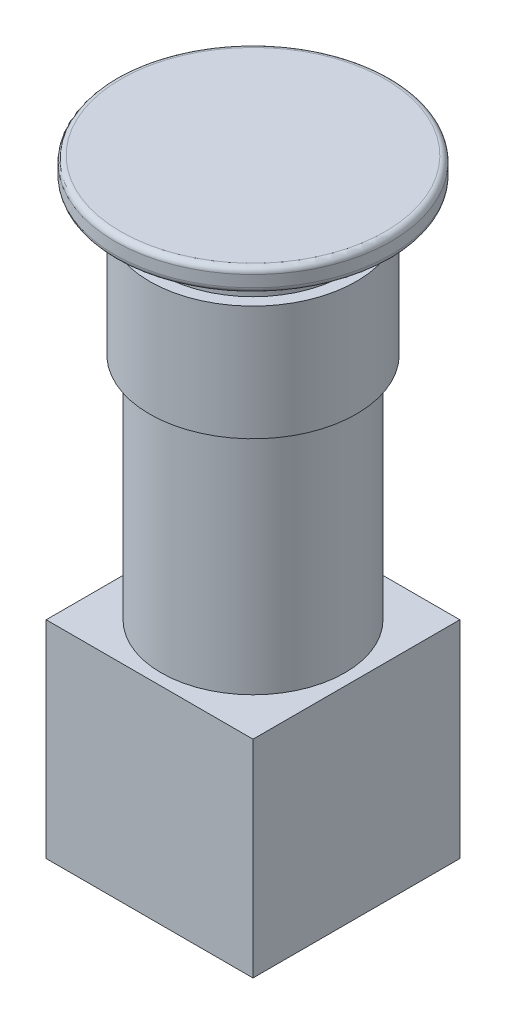
ISO-10303-21;
HEADER;
FILE_DESCRIPTION(('STEP AP214'),'2;1');
FILE_NAME('part.step','',(''),(''),'','','');
FILE_SCHEMA(('AUTOMOTIVE_DESIGN { 1 0 10303 214 1 1 1 1 }'));
ENDSEC;
DATA;
#1=APPLICATION_CONTEXT('core data for automotive mechanical design processes');
#2=APPLICATION_PROTOCOL_DEFINITION('international standard','automotive_design',2000,#1);
#3=PRODUCT_CONTEXT('',#1,'mechanical');
#4=PRODUCT('Part','Part','',(#3));
#5=PRODUCT_RELATED_PRODUCT_CATEGORY('part','',(#4));
#6=PRODUCT_DEFINITION_FORMATION('','',#4);
#7=PRODUCT_DEFINITION_CONTEXT('part definition',#1,'design');
#8=PRODUCT_DEFINITION('design','',#6,#7);
#9=PRODUCT_DEFINITION_SHAPE('','',#8);
#10=(LENGTH_UNIT() NAMED_UNIT(*) SI_UNIT(.MILLI.,.METRE.));
#11=(NAMED_UNIT(*) PLANE_ANGLE_UNIT() SI_UNIT($,.RADIAN.));
#12=(NAMED_UNIT(*) SI_UNIT($,.STERADIAN.) SOLID_ANGLE_UNIT());
#13=UNCERTAINTY_MEASURE_WITH_UNIT(LENGTH_MEASURE(1.E-05),#10,'distance_accuracy_value','');
#14=(GEOMETRIC_REPRESENTATION_CONTEXT(3) GLOBAL_UNCERTAINTY_ASSIGNED_CONTEXT((#13)) GLOBAL_UNIT_ASSIGNED_CONTEXT((#10,
#11,#12)) REPRESENTATION_CONTEXT('',''));
#15=CARTESIAN_POINT('',(0.,0.,0.));
#16=DIRECTION('',(0.,0.,1.));
#17=DIRECTION('',(1.,0.,0.));
#18=AXIS2_PLACEMENT_3D('',#15,#16,#17);
#19=CARTESIAN_POINT('',(0.,48.,0.));
#20=DIRECTION('',(0.,1.,0.));
#21=DIRECTION('',(0.,0.,1.));
#22=AXIS2_PLACEMENT_3D('',#19,#20,#21);
#23=PLANE('',#22);
#24=CARTESIAN_POINT('',(0.,48.,0.));
#25=DIRECTION('',(0.,1.,0.));
#26=DIRECTION('',(0.,0.,1.));
#27=AXIS2_PLACEMENT_3D('',#24,#25,#26);
#28=CIRCLE('',#27,9.);
#29=CARTESIAN_POINT('',(0.,48.,9.));
#30=VERTEX_POINT('',#29);
#31=EDGE_CURVE('E178',#30,#30,#28,.T.);
#32=ORIENTED_EDGE('',*,*,#31,.T.);
#33=EDGE_LOOP('',(#32));
#34=FACE_BOUND('',#33,.T.);
#35=CARTESIAN_POINT('',(0.,48.,0.));
#36=DIRECTION('',(0.,1.,0.));
#37=DIRECTION('',(0.,0.,1.));
#38=AXIS2_PLACEMENT_3D('',#35,#36,#37);
#39=CIRCLE('',#38,8.);
#40=CARTESIAN_POINT('',(0.,48.,8.));
#41=VERTEX_POINT('',#40);
#42=EDGE_CURVE('E186',#41,#41,#39,.T.);
#43=ORIENTED_EDGE('',*,*,#42,.F.);
#44=EDGE_LOOP('',(#43));
#45=FACE_BOUND('',#44,.T.);
#46=ADVANCED_FACE('F33',(#34,#45),#23,.T.);
#47=CARTESIAN_POINT('',(0.,18.,0.));
#48=DIRECTION('',(0.,1.,0.));
#49=DIRECTION('',(0.,0.,1.));
#50=AXIS2_PLACEMENT_3D('',#47,#48,#49);
#51=PLANE('',#50);
#52=DIRECTION('',(0.,0.,1.));
#53=VECTOR('',#52,1.);
#54=CARTESIAN_POINT('',(-9.,18.,-9.));
#55=LINE('',#54,#53);
#56=CARTESIAN_POINT('',(-9.,18.,-9.));
#57=VERTEX_POINT('',#56);
#58=CARTESIAN_POINT('',(-9.,18.,9.));
#59=VERTEX_POINT('',#58);
#60=EDGE_CURVE('E87',#57,#59,#55,.T.);
#61=ORIENTED_EDGE('',*,*,#60,.T.);
#62=DIRECTION('',(1.,0.,0.));
#63=VECTOR('',#62,1.);
#64=CARTESIAN_POINT('',(-9.,18.,9.));
#65=LINE('',#64,#63);
#66=CARTESIAN_POINT('',(9.,18.,9.));
#67=VERTEX_POINT('',#66);
#68=EDGE_CURVE('E81',#59,#67,#65,.T.);
#69=ORIENTED_EDGE('',*,*,#68,.T.);
#70=DIRECTION('',(0.,0.,-1.));
#71=VECTOR('',#70,1.);
#72=CARTESIAN_POINT('',(9.,18.,-9.));
#73=LINE('',#72,#71);
#74=CARTESIAN_POINT('',(9.,18.,-9.));
#75=VERTEX_POINT('',#74);
#76=EDGE_CURVE('E85',#67,#75,#73,.T.);
#77=ORIENTED_EDGE('',*,*,#76,.T.);
#78=DIRECTION('',(-1.,0.,0.));
#79=VECTOR('',#78,1.);
#80=CARTESIAN_POINT('',(-9.,18.,-9.));
#81=LINE('',#80,#79);
#82=EDGE_CURVE('E50',#75,#57,#81,.T.);
#83=ORIENTED_EDGE('',*,*,#82,.T.);
#84=EDGE_LOOP('',(#61,#69,#77,#83));
#85=FACE_BOUND('',#84,.T.);
#86=CARTESIAN_POINT('',(0.,18.,0.));
#87=DIRECTION('',(0.,1.,0.));
#88=DIRECTION('',(0.,0.,1.));
#89=AXIS2_PLACEMENT_3D('',#86,#87,#88);
#90=CIRCLE('',#89,8.);
#91=CARTESIAN_POINT('',(0.,18.,8.));
#92=VERTEX_POINT('',#91);
#93=EDGE_CURVE('E175',#92,#92,#90,.T.);
#94=ORIENTED_EDGE('',*,*,#93,.F.);
#95=EDGE_LOOP('',(#94));
#96=FACE_BOUND('',#95,.T.);
#97=ADVANCED_FACE('F82',(#85,#96),#51,.T.);
#98=CARTESIAN_POINT('',(-9.,18.,-9.));
#99=DIRECTION('',(1.,0.,0.));
#100=DIRECTION('',(0.,0.,-1.));
#101=AXIS2_PLACEMENT_3D('',#98,#99,#100);
#102=PLANE('',#101);
#103=DIRECTION('',(0.,0.,1.));
#104=VECTOR('',#103,1.);
#105=CARTESIAN_POINT('',(-9.,0.,-9.));
#106=LINE('',#105,#104);
#107=CARTESIAN_POINT('',(-9.,0.,-9.));
#108=VERTEX_POINT('',#107);
#109=CARTESIAN_POINT('',(-9.,0.,9.));
#110=VERTEX_POINT('',#109);
#111=EDGE_CURVE('E102',#108,#110,#106,.T.);
#112=ORIENTED_EDGE('',*,*,#111,.T.);
#113=DIRECTION('',(0.,-1.,0.));
#114=VECTOR('',#113,1.);
#115=CARTESIAN_POINT('',(-9.,18.,9.));
#116=LINE('',#115,#114);
#117=EDGE_CURVE('E93',#59,#110,#116,.T.);
#118=ORIENTED_EDGE('',*,*,#117,.F.);
#119=ORIENTED_EDGE('',*,*,#60,.F.);
#120=DIRECTION('',(0.,-1.,0.));
#121=VECTOR('',#120,1.);
#122=CARTESIAN_POINT('',(-9.,18.,-9.));
#123=LINE('',#122,#121);
#124=EDGE_CURVE('E98',#57,#108,#123,.T.);
#125=ORIENTED_EDGE('',*,*,#124,.T.);
#126=EDGE_LOOP('',(#112,#118,#119,#125));
#127=FACE_BOUND('',#126,.T.);
#128=ADVANCED_FACE('F138',(#127),#102,.F.);
#129=CARTESIAN_POINT('',(-9.,18.,9.));
#130=DIRECTION('',(0.,0.,-1.));
#131=DIRECTION('',(-1.,0.,0.));
#132=AXIS2_PLACEMENT_3D('',#129,#130,#131);
#133=PLANE('',#132);
#134=DIRECTION('',(1.,0.,0.));
#135=VECTOR('',#134,1.);
#136=CARTESIAN_POINT('',(-9.,0.,9.));
#137=LINE('',#136,#135);
#138=CARTESIAN_POINT('',(9.,0.,9.));
#139=VERTEX_POINT('',#138);
#140=EDGE_CURVE('E92',#110,#139,#137,.T.);
#141=ORIENTED_EDGE('',*,*,#140,.T.);
#142=DIRECTION('',(0.,-1.,0.));
#143=VECTOR('',#142,1.);
#144=CARTESIAN_POINT('',(9.,18.,9.));
#145=LINE('',#144,#143);
#146=EDGE_CURVE('E90',#67,#139,#145,.T.);
#147=ORIENTED_EDGE('',*,*,#146,.F.);
#148=ORIENTED_EDGE('',*,*,#68,.F.);
#149=ORIENTED_EDGE('',*,*,#117,.T.);
#150=EDGE_LOOP('',(#141,#147,#148,#149));
#151=FACE_BOUND('',#150,.T.);
#152=ADVANCED_FACE('F91',(#151),#133,.F.);
#153=CARTESIAN_POINT('',(9.,18.,-9.));
#154=DIRECTION('',(-1.,0.,0.));
#155=DIRECTION('',(0.,0.,1.));
#156=AXIS2_PLACEMENT_3D('',#153,#154,#155);
#157=PLANE('',#156);
#158=DIRECTION('',(0.,0.,-1.));
#159=VECTOR('',#158,1.);
#160=CARTESIAN_POINT('',(9.,0.,-9.));
#161=LINE('',#160,#159);
#162=CARTESIAN_POINT('',(9.,0.,-9.));
#163=VERTEX_POINT('',#162);
#164=EDGE_CURVE('E67',#139,#163,#161,.T.);
#165=ORIENTED_EDGE('',*,*,#164,.T.);
#166=DIRECTION('',(0.,-1.,0.));
#167=VECTOR('',#166,1.);
#168=CARTESIAN_POINT('',(9.,18.,-9.));
#169=LINE('',#168,#167);
#170=EDGE_CURVE('E94',#75,#163,#169,.T.);
#171=ORIENTED_EDGE('',*,*,#170,.F.);
#172=ORIENTED_EDGE('',*,*,#76,.F.);
#173=ORIENTED_EDGE('',*,*,#146,.T.);
#174=EDGE_LOOP('',(#165,#171,#172,#173));
#175=FACE_BOUND('',#174,.T.);
#176=ADVANCED_FACE('F96',(#175),#157,.F.);
#177=CARTESIAN_POINT('',(-9.,18.,-9.));
#178=DIRECTION('',(0.,0.,1.));
#179=DIRECTION('',(1.,0.,0.));
#180=AXIS2_PLACEMENT_3D('',#177,#178,#179);
#181=PLANE('',#180);
#182=DIRECTION('',(-1.,0.,0.));
#183=VECTOR('',#182,1.);
#184=CARTESIAN_POINT('',(-9.,0.,-9.));
#185=LINE('',#184,#183);
#186=EDGE_CURVE('E73',#163,#108,#185,.T.);
#187=ORIENTED_EDGE('',*,*,#186,.T.);
#188=ORIENTED_EDGE('',*,*,#124,.F.);
#189=ORIENTED_EDGE('',*,*,#82,.F.);
#190=ORIENTED_EDGE('',*,*,#170,.T.);
#191=EDGE_LOOP('',(#187,#188,#189,#190));
#192=FACE_BOUND('',#191,.T.);
#193=ADVANCED_FACE('F161',(#192),#181,.F.);
#194=CARTESIAN_POINT('',(0.,0.,0.));
#195=DIRECTION('',(0.,1.,0.));
#196=DIRECTION('',(0.,0.,1.));
#197=AXIS2_PLACEMENT_3D('',#194,#195,#196);
#198=PLANE('',#197);
#199=ORIENTED_EDGE('',*,*,#111,.F.);
#200=ORIENTED_EDGE('',*,*,#186,.F.);
#201=ORIENTED_EDGE('',*,*,#164,.F.);
#202=ORIENTED_EDGE('',*,*,#140,.F.);
#203=EDGE_LOOP('',(#199,#200,#201,#202));
#204=FACE_BOUND('',#203,.T.);
#205=ADVANCED_FACE('F156',(#204),#198,.F.);
#206=CARTESIAN_POINT('',(0.,38.,0.));
#207=DIRECTION('',(0.,-1.,0.));
#208=DIRECTION('',(0.,0.,-1.));
#209=AXIS2_PLACEMENT_3D('',#206,#207,#208);
#210=CYLINDRICAL_SURFACE('',#209,8.);
#211=CARTESIAN_POINT('',(0.,38.,0.));
#212=DIRECTION('',(0.,1.,0.));
#213=DIRECTION('',(0.,0.,1.));
#214=AXIS2_PLACEMENT_3D('',#211,#212,#213);
#215=CIRCLE('',#214,8.);
#216=CARTESIAN_POINT('',(0.,38.,8.));
#217=VERTEX_POINT('',#216);
#218=EDGE_CURVE('E105',#217,#217,#215,.T.);
#219=ORIENTED_EDGE('',*,*,#218,.F.);
#220=EDGE_LOOP('',(#219));
#221=FACE_BOUND('',#220,.T.);
#222=ORIENTED_EDGE('',*,*,#93,.T.);
#223=EDGE_LOOP('',(#222));
#224=FACE_BOUND('',#223,.T.);
#225=ADVANCED_FACE('F150',(#221,#224),#210,.T.);
#226=CARTESIAN_POINT('',(0.,38.,0.));
#227=DIRECTION('',(0.,1.,0.));
#228=DIRECTION('',(0.,0.,1.));
#229=AXIS2_PLACEMENT_3D('',#226,#227,#228);
#230=PLANE('',#229);
#231=CARTESIAN_POINT('',(0.,38.,0.));
#232=DIRECTION('',(0.,1.,0.));
#233=DIRECTION('',(0.,0.,1.));
#234=AXIS2_PLACEMENT_3D('',#231,#232,#233);
#235=CIRCLE('',#234,9.);
#236=CARTESIAN_POINT('',(0.,38.,9.));
#237=VERTEX_POINT('',#236);
#238=EDGE_CURVE('E181',#237,#237,#235,.T.);
#239=ORIENTED_EDGE('',*,*,#238,.F.);
#240=EDGE_LOOP('',(#239));
#241=FACE_BOUND('',#240,.T.);
#242=ORIENTED_EDGE('',*,*,#218,.T.);
#243=EDGE_LOOP('',(#242));
#244=FACE_BOUND('',#243,.T.);
#245=ADVANCED_FACE('F146',(#241,#244),#230,.F.);
#246=CARTESIAN_POINT('',(0.,48.,0.));
#247=DIRECTION('',(0.,-1.,0.));
#248=DIRECTION('',(0.,0.,-1.));
#249=AXIS2_PLACEMENT_3D('',#246,#247,#248);
#250=CYLINDRICAL_SURFACE('',#249,9.);
#251=ORIENTED_EDGE('',*,*,#31,.F.);
#252=EDGE_LOOP('',(#251));
#253=FACE_BOUND('',#252,.T.);
#254=ORIENTED_EDGE('',*,*,#238,.T.);
#255=EDGE_LOOP('',(#254));
#256=FACE_BOUND('',#255,.T.);
#257=ADVANCED_FACE('F149',(#253,#256),#250,.T.);
#258=CARTESIAN_POINT('',(0.,51.,0.));
#259=DIRECTION('',(0.,-1.,0.));
#260=DIRECTION('',(0.,0.,-1.));
#261=AXIS2_PLACEMENT_3D('',#258,#259,#260);
#262=CYLINDRICAL_SURFACE('',#261,8.);
#263=CARTESIAN_POINT('',(0.,51.,0.));
#264=DIRECTION('',(0.,1.,0.));
#265=DIRECTION('',(0.,0.,1.));
#266=AXIS2_PLACEMENT_3D('',#263,#264,#265);
#267=CIRCLE('',#266,8.);
#268=CARTESIAN_POINT('',(0.,51.,8.));
#269=VERTEX_POINT('',#268);
#270=EDGE_CURVE('E184',#269,#269,#267,.T.);
#271=ORIENTED_EDGE('',*,*,#270,.F.);
#272=EDGE_LOOP('',(#271));
#273=FACE_BOUND('',#272,.T.);
#274=ORIENTED_EDGE('',*,*,#42,.T.);
#275=EDGE_LOOP('',(#274));
#276=FACE_BOUND('',#275,.T.);
#277=ADVANCED_FACE('F144',(#273,#276),#262,.T.);
#278=CARTESIAN_POINT('',(0.,51.,0.));
#279=DIRECTION('',(0.,1.,0.));
#280=DIRECTION('',(0.,0.,1.));
#281=AXIS2_PLACEMENT_3D('',#278,#279,#280);
#282=PLANE('',#281);
#283=CARTESIAN_POINT('',(0.,51.,0.));
#284=DIRECTION('',(0.,1.,0.));
#285=DIRECTION('',(0.,0.,1.));
#286=AXIS2_PLACEMENT_3D('',#283,#284,#285);
#287=CIRCLE('',#286,11.5);
#288=CARTESIAN_POINT('',(0.,51.,11.5));
#289=VERTEX_POINT('',#288);
#290=EDGE_CURVE('E11',#289,#289,#287,.F.);
#291=ORIENTED_EDGE('',*,*,#290,.T.);
#292=EDGE_LOOP('',(#291));
#293=FACE_BOUND('',#292,.T.);
#294=ORIENTED_EDGE('',*,*,#270,.T.);
#295=EDGE_LOOP('',(#294));
#296=FACE_BOUND('',#295,.T.);
#297=ADVANCED_FACE('F192',(#293,#296),#282,.F.);
#298=CARTESIAN_POINT('',(0.,53.,0.));
#299=DIRECTION('',(0.,-1.,0.));
#300=DIRECTION('',(0.,0.,-1.));
#301=AXIS2_PLACEMENT_3D('',#298,#299,#300);
#302=CYLINDRICAL_SURFACE('',#301,12.);
#303=CARTESIAN_POINT('',(0.,51.5,0.));
#304=DIRECTION('',(0.,1.,0.));
#305=DIRECTION('',(0.,0.,1.));
#306=AXIS2_PLACEMENT_3D('',#303,#304,#305);
#307=CIRCLE('',#306,12.);
#308=CARTESIAN_POINT('',(0.,51.5,12.));
#309=VERTEX_POINT('',#308);
#310=EDGE_CURVE('E42',#309,#309,#307,.T.);
#311=ORIENTED_EDGE('',*,*,#310,.T.);
#312=EDGE_LOOP('',(#311));
#313=FACE_BOUND('',#312,.T.);
#314=CARTESIAN_POINT('',(0.,52.5,0.));
#315=DIRECTION('',(0.,1.,0.));
#316=DIRECTION('',(0.,0.,1.));
#317=AXIS2_PLACEMENT_3D('',#314,#315,#316);
#318=CIRCLE('',#317,12.);
#319=CARTESIAN_POINT('',(0.,52.5,12.));
#320=VERTEX_POINT('',#319);
#321=EDGE_CURVE('E115',#320,#320,#318,.F.);
#322=ORIENTED_EDGE('',*,*,#321,.T.);
#323=EDGE_LOOP('',(#322));
#324=FACE_BOUND('',#323,.T.);
#325=ADVANCED_FACE('F120',(#313,#324),#302,.T.);
#326=CARTESIAN_POINT('',(0.,53.,0.));
#327=DIRECTION('',(0.,1.,0.));
#328=DIRECTION('',(0.,0.,1.));
#329=AXIS2_PLACEMENT_3D('',#326,#327,#328);
#330=PLANE('',#329);
#331=CARTESIAN_POINT('',(0.,53.,0.));
#332=DIRECTION('',(0.,1.,0.));
#333=DIRECTION('',(0.,0.,1.));
#334=AXIS2_PLACEMENT_3D('',#331,#332,#333);
#335=CIRCLE('',#334,11.5);
#336=CARTESIAN_POINT('',(0.,53.,11.5));
#337=VERTEX_POINT('',#336);
#338=EDGE_CURVE('E112',#337,#337,#335,.T.);
#339=ORIENTED_EDGE('',*,*,#338,.T.);
#340=EDGE_LOOP('',(#339));
#341=FACE_BOUND('',#340,.T.);
#342=ADVANCED_FACE('F129',(#341),#330,.T.);
#343=CARTESIAN_POINT('',(0.,52.5,0.));
#344=DIRECTION('',(0.,1.,0.));
#345=DIRECTION('',(0.,0.,1.));
#346=AXIS2_PLACEMENT_3D('',#343,#344,#345);
#347=TOROIDAL_SURFACE('',#346,11.5,0.5);
#348=ORIENTED_EDGE('',*,*,#321,.F.);
#349=EDGE_LOOP('',(#348));
#350=FACE_BOUND('',#349,.T.);
#351=ORIENTED_EDGE('',*,*,#338,.F.);
#352=EDGE_LOOP('',(#351));
#353=FACE_BOUND('',#352,.T.);
#354=ADVANCED_FACE('F124',(#350,#353),#347,.T.);
#355=CARTESIAN_POINT('',(0.,51.5,0.));
#356=DIRECTION('',(0.,1.,0.));
#357=DIRECTION('',(0.,0.,1.));
#358=AXIS2_PLACEMENT_3D('',#355,#356,#357);
#359=TOROIDAL_SURFACE('',#358,11.5,0.5);
#360=ORIENTED_EDGE('',*,*,#290,.F.);
#361=EDGE_LOOP('',(#360));
#362=FACE_BOUND('',#361,.T.);
#363=ORIENTED_EDGE('',*,*,#310,.F.);
#364=EDGE_LOOP('',(#363));
#365=FACE_BOUND('',#364,.T.);
#366=ADVANCED_FACE('F35',(#362,#365),#359,.T.);
#367=CLOSED_SHELL('',(#46,#97,#128,#152,#176,#193,#205,#225,#245,#257,#277,#297,#325,#342,#354,#366));
#368=MANIFOLD_SOLID_BREP('B2',#367);
#369=ADVANCED_BREP_SHAPE_REPRESENTATION('',(#18,#368),#14);
#370=SHAPE_DEFINITION_REPRESENTATION(#9,#369);
ENDSEC;
END-ISO-10303-21;
